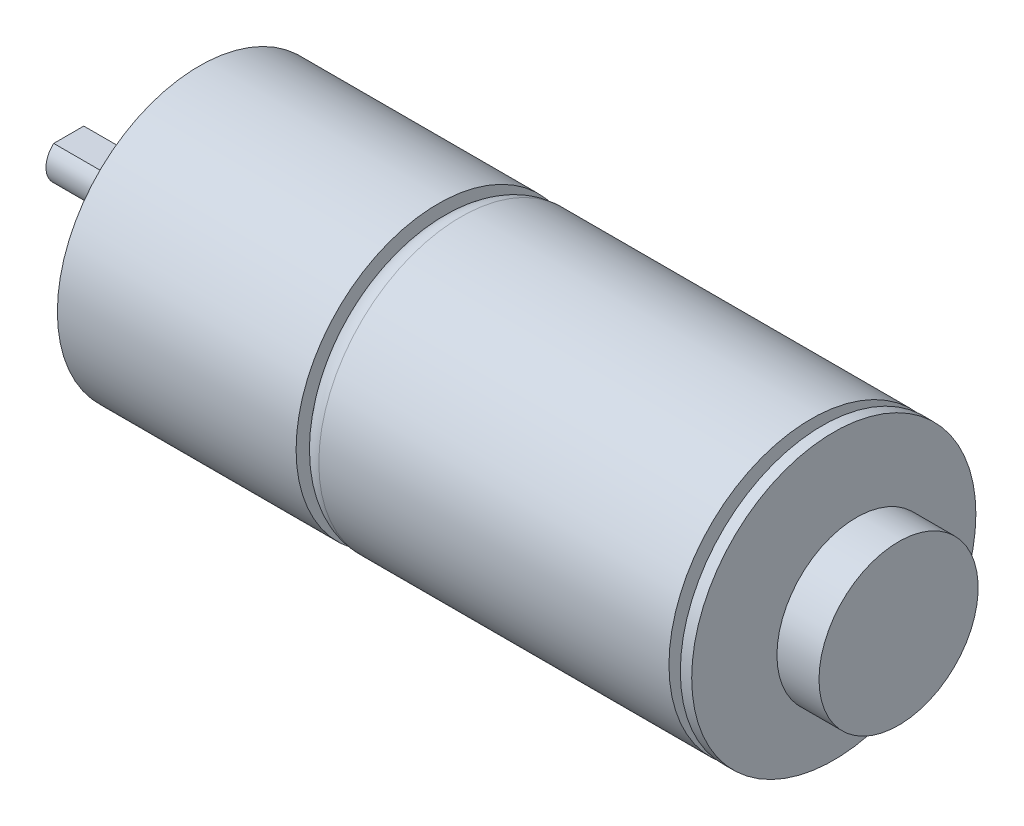
ISO-10303-21;
HEADER;
FILE_DESCRIPTION(('STEP AP214'),'2;1');
FILE_NAME('part.step','',(''),(''),'','','');
FILE_SCHEMA(('AUTOMOTIVE_DESIGN { 1 0 10303 214 1 1 1 1 }'));
ENDSEC;
DATA;
#1=APPLICATION_CONTEXT('core data for automotive mechanical design processes');
#2=APPLICATION_PROTOCOL_DEFINITION('international standard','automotive_design',2000,#1);
#3=PRODUCT_CONTEXT('',#1,'mechanical');
#4=PRODUCT('Part','Part','',(#3));
#5=PRODUCT_RELATED_PRODUCT_CATEGORY('part','',(#4));
#6=PRODUCT_DEFINITION_FORMATION('','',#4);
#7=PRODUCT_DEFINITION_CONTEXT('part definition',#1,'design');
#8=PRODUCT_DEFINITION('design','',#6,#7);
#9=PRODUCT_DEFINITION_SHAPE('','',#8);
#10=(LENGTH_UNIT() NAMED_UNIT(*) SI_UNIT(.MILLI.,.METRE.));
#11=(NAMED_UNIT(*) PLANE_ANGLE_UNIT() SI_UNIT($,.RADIAN.));
#12=(NAMED_UNIT(*) SI_UNIT($,.STERADIAN.) SOLID_ANGLE_UNIT());
#13=UNCERTAINTY_MEASURE_WITH_UNIT(LENGTH_MEASURE(1.E-05),#10,'distance_accuracy_value','');
#14=(GEOMETRIC_REPRESENTATION_CONTEXT(3) GLOBAL_UNCERTAINTY_ASSIGNED_CONTEXT((#13)) GLOBAL_UNIT_ASSIGNED_CONTEXT((#10,
#11,#12)) REPRESENTATION_CONTEXT('',''));
#15=CARTESIAN_POINT('',(0.,0.,0.));
#16=DIRECTION('',(0.,0.,1.));
#17=DIRECTION('',(1.,0.,0.));
#18=AXIS2_PLACEMENT_3D('',#15,#16,#17);
#19=CARTESIAN_POINT('',(0.,0.,0.));
#20=DIRECTION('',(1.,0.,0.));
#21=DIRECTION('',(0.,0.,-1.));
#22=AXIS2_PLACEMENT_3D('',#19,#20,#21);
#23=PLANE('',#22);
#24=CARTESIAN_POINT('',(0.,0.,0.));
#25=DIRECTION('',(-1.,0.,0.));
#26=DIRECTION('',(0.,0.,1.));
#27=AXIS2_PLACEMENT_3D('',#24,#25,#26);
#28=CIRCLE('',#27,2.);
#29=CARTESIAN_POINT('',(0.,1.5,-1.32287565553229));
#30=VERTEX_POINT('',#29);
#31=CARTESIAN_POINT('',(0.,1.5,1.32287565553229));
#32=VERTEX_POINT('',#31);
#33=EDGE_CURVE('E149',#30,#32,#28,.T.);
#34=ORIENTED_EDGE('',*,*,#33,.T.);
#35=DIRECTION('',(0.,0.,1.));
#36=VECTOR('',#35,1.);
#37=CARTESIAN_POINT('',(0.,1.5,-12.5));
#38=LINE('',#37,#36);
#39=EDGE_CURVE('E84',#30,#32,#38,.T.);
#40=ORIENTED_EDGE('',*,*,#39,.F.);
#41=EDGE_LOOP('',(#34,#40));
#42=FACE_BOUND('',#41,.T.);
#43=ADVANCED_FACE('F45',(#42),#23,.F.);
#44=CARTESIAN_POINT('',(0.,0.,0.));
#45=DIRECTION('',(-1.,0.,0.));
#46=DIRECTION('',(0.,0.,1.));
#47=AXIS2_PLACEMENT_3D('',#44,#45,#46);
#48=CYLINDRICAL_SURFACE('',#47,2.);
#49=CARTESIAN_POINT('',(8.,0.,0.));
#50=DIRECTION('',(1.,0.,0.));
#51=DIRECTION('',(0.,0.,-1.));
#52=AXIS2_PLACEMENT_3D('',#49,#50,#51);
#53=CIRCLE('',#52,2.);
#54=CARTESIAN_POINT('',(8.,1.5,-1.3228756555323));
#55=VERTEX_POINT('',#54);
#56=CARTESIAN_POINT('',(8.,1.5,1.32287565553229));
#57=VERTEX_POINT('',#56);
#58=EDGE_CURVE('E52',#55,#57,#53,.T.);
#59=ORIENTED_EDGE('',*,*,#58,.T.);
#60=DIRECTION('',(-1.,0.,0.));
#61=VECTOR('',#60,1.);
#62=CARTESIAN_POINT('',(0.,1.5,1.3228756555323));
#63=LINE('',#62,#61);
#64=EDGE_CURVE('E13',#57,#32,#63,.T.);
#65=ORIENTED_EDGE('',*,*,#64,.T.);
#66=ORIENTED_EDGE('',*,*,#33,.F.);
#67=DIRECTION('',(-1.,0.,0.));
#68=VECTOR('',#67,1.);
#69=CARTESIAN_POINT('',(0.,1.5,-1.3228756555323));
#70=LINE('',#69,#68);
#71=EDGE_CURVE('E80',#30,#55,#70,.F.);
#72=ORIENTED_EDGE('',*,*,#71,.T.);
#73=EDGE_LOOP('',(#59,#65,#66,#72));
#74=FACE_BOUND('',#73,.T.);
#75=CARTESIAN_POINT('',(9.,0.,0.));
#76=DIRECTION('',(-1.,0.,0.));
#77=DIRECTION('',(0.,0.,1.));
#78=AXIS2_PLACEMENT_3D('',#75,#76,#77);
#79=CIRCLE('',#78,2.);
#80=CARTESIAN_POINT('',(9.,0.,2.));
#81=VERTEX_POINT('',#80);
#82=EDGE_CURVE('E146',#81,#81,#79,.T.);
#83=ORIENTED_EDGE('',*,*,#82,.T.);
#84=EDGE_LOOP('',(#83));
#85=FACE_BOUND('',#84,.T.);
#86=ADVANCED_FACE('F76',(#74,#85),#48,.T.);
#87=CARTESIAN_POINT('',(10.5,0.,0.));
#88=DIRECTION('',(-1.,0.,0.));
#89=DIRECTION('',(0.,0.,1.));
#90=AXIS2_PLACEMENT_3D('',#87,#88,#89);
#91=TOROIDAL_SURFACE('',#90,2.,1.5);
#92=ORIENTED_EDGE('',*,*,#82,.F.);
#93=EDGE_LOOP('',(#92));
#94=FACE_BOUND('',#93,.T.);
#95=CARTESIAN_POINT('',(10.5,0.,0.));
#96=DIRECTION('',(-1.,0.,0.));
#97=DIRECTION('',(0.,0.,1.));
#98=AXIS2_PLACEMENT_3D('',#95,#96,#97);
#99=CIRCLE('',#98,3.5);
#100=CARTESIAN_POINT('',(10.5,0.,3.5));
#101=VERTEX_POINT('',#100);
#102=EDGE_CURVE('E143',#101,#101,#99,.T.);
#103=ORIENTED_EDGE('',*,*,#102,.T.);
#104=EDGE_LOOP('',(#103));
#105=FACE_BOUND('',#104,.T.);
#106=ADVANCED_FACE('F157',(#94,#105),#91,.T.);
#107=CARTESIAN_POINT('',(0.,0.,0.));
#108=DIRECTION('',(-1.,0.,0.));
#109=DIRECTION('',(0.,0.,1.));
#110=AXIS2_PLACEMENT_3D('',#107,#108,#109);
#111=CYLINDRICAL_SURFACE('',#110,3.5);
#112=ORIENTED_EDGE('',*,*,#102,.F.);
#113=EDGE_LOOP('',(#112));
#114=FACE_BOUND('',#113,.T.);
#115=CARTESIAN_POINT('',(11.5,0.,0.));
#116=DIRECTION('',(-1.,0.,0.));
#117=DIRECTION('',(0.,0.,1.));
#118=AXIS2_PLACEMENT_3D('',#115,#116,#117);
#119=CIRCLE('',#118,3.5);
#120=CARTESIAN_POINT('',(11.5,0.,3.5));
#121=VERTEX_POINT('',#120);
#122=EDGE_CURVE('E140',#121,#121,#119,.T.);
#123=ORIENTED_EDGE('',*,*,#122,.T.);
#124=EDGE_LOOP('',(#123));
#125=FACE_BOUND('',#124,.T.);
#126=ADVANCED_FACE('F162',(#114,#125),#111,.T.);
#127=CARTESIAN_POINT('',(11.5,3.5,0.));
#128=DIRECTION('',(1.,0.,0.));
#129=DIRECTION('',(0.,0.,-1.));
#130=AXIS2_PLACEMENT_3D('',#127,#128,#129);
#131=PLANE('',#130);
#132=CARTESIAN_POINT('',(11.5,0.,-8.5));
#133=DIRECTION('',(-1.,0.,0.));
#134=DIRECTION('',(0.,0.,1.));
#135=AXIS2_PLACEMENT_3D('',#132,#133,#134);
#136=CIRCLE('',#135,1.24999999999999);
#137=CARTESIAN_POINT('',(11.5,0.,-7.25000000000001));
#138=VERTEX_POINT('',#137);
#139=EDGE_CURVE('E86',#138,#138,#136,.T.);
#140=ORIENTED_EDGE('',*,*,#139,.F.);
#141=EDGE_LOOP('',(#140));
#142=FACE_BOUND('',#141,.T.);
#143=CARTESIAN_POINT('',(11.5,0.,8.5));
#144=DIRECTION('',(-1.,0.,0.));
#145=DIRECTION('',(0.,0.,1.));
#146=AXIS2_PLACEMENT_3D('',#143,#144,#145);
#147=CIRCLE('',#146,1.24999999999999);
#148=CARTESIAN_POINT('',(11.5,0.,9.74999999999999));
#149=VERTEX_POINT('',#148);
#150=EDGE_CURVE('E95',#149,#149,#147,.T.);
#151=ORIENTED_EDGE('',*,*,#150,.F.);
#152=EDGE_LOOP('',(#151));
#153=FACE_BOUND('',#152,.T.);
#154=ORIENTED_EDGE('',*,*,#122,.F.);
#155=EDGE_LOOP('',(#154));
#156=FACE_BOUND('',#155,.T.);
#157=CARTESIAN_POINT('',(11.5,0.,0.));
#158=DIRECTION('',(-1.,0.,0.));
#159=DIRECTION('',(0.,0.,1.));
#160=AXIS2_PLACEMENT_3D('',#157,#158,#159);
#161=CIRCLE('',#160,12.5);
#162=CARTESIAN_POINT('',(11.5,0.,12.5));
#163=VERTEX_POINT('',#162);
#164=EDGE_CURVE('E137',#163,#163,#161,.T.);
#165=ORIENTED_EDGE('',*,*,#164,.T.);
#166=EDGE_LOOP('',(#165));
#167=FACE_BOUND('',#166,.T.);
#168=ADVANCED_FACE('F168',(#142,#153,#156,#167),#131,.F.);
#169=CARTESIAN_POINT('',(0.,0.,0.));
#170=DIRECTION('',(-1.,0.,0.));
#171=DIRECTION('',(0.,0.,1.));
#172=AXIS2_PLACEMENT_3D('',#169,#170,#171);
#173=CYLINDRICAL_SURFACE('',#172,12.5);
#174=ORIENTED_EDGE('',*,*,#164,.F.);
#175=EDGE_LOOP('',(#174));
#176=FACE_BOUND('',#175,.T.);
#177=CARTESIAN_POINT('',(32.5,0.,0.));
#178=DIRECTION('',(-1.,0.,0.));
#179=DIRECTION('',(0.,0.,1.));
#180=AXIS2_PLACEMENT_3D('',#177,#178,#179);
#181=CIRCLE('',#180,12.5);
#182=CARTESIAN_POINT('',(32.5,0.,12.5));
#183=VERTEX_POINT('',#182);
#184=EDGE_CURVE('E134',#183,#183,#181,.T.);
#185=ORIENTED_EDGE('',*,*,#184,.T.);
#186=EDGE_LOOP('',(#185));
#187=FACE_BOUND('',#186,.T.);
#188=ADVANCED_FACE('F172',(#176,#187),#173,.T.);
#189=CARTESIAN_POINT('',(32.5,12.5,0.));
#190=DIRECTION('',(-1.,0.,0.));
#191=DIRECTION('',(0.,0.,1.));
#192=AXIS2_PLACEMENT_3D('',#189,#190,#191);
#193=PLANE('',#192);
#194=ORIENTED_EDGE('',*,*,#184,.F.);
#195=EDGE_LOOP('',(#194));
#196=FACE_BOUND('',#195,.T.);
#197=CARTESIAN_POINT('',(32.5,0.,0.));
#198=DIRECTION('',(-1.,0.,0.));
#199=DIRECTION('',(0.,0.,1.));
#200=AXIS2_PLACEMENT_3D('',#197,#198,#199);
#201=CIRCLE('',#200,10.5);
#202=CARTESIAN_POINT('',(32.5,0.,10.5));
#203=VERTEX_POINT('',#202);
#204=EDGE_CURVE('E131',#203,#203,#201,.T.);
#205=ORIENTED_EDGE('',*,*,#204,.T.);
#206=EDGE_LOOP('',(#205));
#207=FACE_BOUND('',#206,.T.);
#208=ADVANCED_FACE('F176',(#196,#207),#193,.F.);
#209=CARTESIAN_POINT('',(34.5,0.,0.));
#210=DIRECTION('',(-1.,0.,0.));
#211=DIRECTION('',(0.,0.,1.));
#212=AXIS2_PLACEMENT_3D('',#209,#210,#211);
#213=TOROIDAL_SURFACE('',#212,10.5,2.);
#214=ORIENTED_EDGE('',*,*,#204,.F.);
#215=EDGE_LOOP('',(#214));
#216=FACE_BOUND('',#215,.T.);
#217=CARTESIAN_POINT('',(34.5,0.,0.));
#218=DIRECTION('',(-1.,0.,0.));
#219=DIRECTION('',(0.,0.,1.));
#220=AXIS2_PLACEMENT_3D('',#217,#218,#219);
#221=CIRCLE('',#220,12.5);
#222=CARTESIAN_POINT('',(34.5,0.,12.5));
#223=VERTEX_POINT('',#222);
#224=EDGE_CURVE('E128',#223,#223,#221,.T.);
#225=ORIENTED_EDGE('',*,*,#224,.T.);
#226=EDGE_LOOP('',(#225));
#227=FACE_BOUND('',#226,.T.);
#228=ADVANCED_FACE('F180',(#216,#227),#213,.T.);
#229=CARTESIAN_POINT('',(0.,0.,0.));
#230=DIRECTION('',(-1.,0.,0.));
#231=DIRECTION('',(0.,0.,1.));
#232=AXIS2_PLACEMENT_3D('',#229,#230,#231);
#233=CYLINDRICAL_SURFACE('',#232,12.5);
#234=ORIENTED_EDGE('',*,*,#224,.F.);
#235=EDGE_LOOP('',(#234));
#236=FACE_BOUND('',#235,.T.);
#237=CARTESIAN_POINT('',(65.3,0.,0.));
#238=DIRECTION('',(-1.,0.,0.));
#239=DIRECTION('',(0.,0.,1.));
#240=AXIS2_PLACEMENT_3D('',#237,#238,#239);
#241=CIRCLE('',#240,12.5);
#242=CARTESIAN_POINT('',(65.3,0.,12.5));
#243=VERTEX_POINT('',#242);
#244=EDGE_CURVE('E125',#243,#243,#241,.T.);
#245=ORIENTED_EDGE('',*,*,#244,.T.);
#246=EDGE_LOOP('',(#245));
#247=FACE_BOUND('',#246,.T.);
#248=ADVANCED_FACE('F184',(#236,#247),#233,.T.);
#249=CARTESIAN_POINT('',(65.3,12.5,0.));
#250=DIRECTION('',(-1.,0.,0.));
#251=DIRECTION('',(0.,0.,1.));
#252=AXIS2_PLACEMENT_3D('',#249,#250,#251);
#253=PLANE('',#252);
#254=ORIENTED_EDGE('',*,*,#244,.F.);
#255=EDGE_LOOP('',(#254));
#256=FACE_BOUND('',#255,.T.);
#257=CARTESIAN_POINT('',(65.3,0.,0.));
#258=DIRECTION('',(-1.,0.,0.));
#259=DIRECTION('',(0.,0.,1.));
#260=AXIS2_PLACEMENT_3D('',#257,#258,#259);
#261=CIRCLE('',#260,3.5);
#262=CARTESIAN_POINT('',(65.3,0.,3.5));
#263=VERTEX_POINT('',#262);
#264=EDGE_CURVE('E122',#263,#263,#261,.T.);
#265=ORIENTED_EDGE('',*,*,#264,.T.);
#266=EDGE_LOOP('',(#265));
#267=FACE_BOUND('',#266,.T.);
#268=ADVANCED_FACE('F188',(#256,#267),#253,.F.);
#269=CARTESIAN_POINT('',(0.,0.,0.));
#270=DIRECTION('',(-1.,0.,0.));
#271=DIRECTION('',(0.,0.,1.));
#272=AXIS2_PLACEMENT_3D('',#269,#270,#271);
#273=CYLINDRICAL_SURFACE('',#272,3.5);
#274=ORIENTED_EDGE('',*,*,#264,.F.);
#275=EDGE_LOOP('',(#274));
#276=FACE_BOUND('',#275,.T.);
#277=CARTESIAN_POINT('',(66.3,0.,0.));
#278=DIRECTION('',(-1.,0.,0.));
#279=DIRECTION('',(0.,0.,1.));
#280=AXIS2_PLACEMENT_3D('',#277,#278,#279);
#281=CIRCLE('',#280,3.5);
#282=CARTESIAN_POINT('',(66.3,0.,3.5));
#283=VERTEX_POINT('',#282);
#284=EDGE_CURVE('E119',#283,#283,#281,.T.);
#285=ORIENTED_EDGE('',*,*,#284,.T.);
#286=EDGE_LOOP('',(#285));
#287=FACE_BOUND('',#286,.T.);
#288=ADVANCED_FACE('F192',(#276,#287),#273,.T.);
#289=CARTESIAN_POINT('',(66.3,3.5,0.));
#290=DIRECTION('',(1.,0.,0.));
#291=DIRECTION('',(0.,0.,-1.));
#292=AXIS2_PLACEMENT_3D('',#289,#290,#291);
#293=PLANE('',#292);
#294=ORIENTED_EDGE('',*,*,#284,.F.);
#295=EDGE_LOOP('',(#294));
#296=FACE_BOUND('',#295,.T.);
#297=CARTESIAN_POINT('',(66.3,0.,0.));
#298=DIRECTION('',(-1.,0.,0.));
#299=DIRECTION('',(0.,0.,1.));
#300=AXIS2_PLACEMENT_3D('',#297,#298,#299);
#301=CIRCLE('',#300,12.5);
#302=CARTESIAN_POINT('',(66.3,0.,12.5));
#303=VERTEX_POINT('',#302);
#304=EDGE_CURVE('E116',#303,#303,#301,.T.);
#305=ORIENTED_EDGE('',*,*,#304,.T.);
#306=EDGE_LOOP('',(#305));
#307=FACE_BOUND('',#306,.T.);
#308=ADVANCED_FACE('F196',(#296,#307),#293,.F.);
#309=CARTESIAN_POINT('',(0.,0.,0.));
#310=DIRECTION('',(-1.,0.,0.));
#311=DIRECTION('',(0.,0.,1.));
#312=AXIS2_PLACEMENT_3D('',#309,#310,#311);
#313=CYLINDRICAL_SURFACE('',#312,12.5);
#314=ORIENTED_EDGE('',*,*,#304,.F.);
#315=EDGE_LOOP('',(#314));
#316=FACE_BOUND('',#315,.T.);
#317=CARTESIAN_POINT('',(67.3,0.,0.));
#318=DIRECTION('',(-1.,0.,0.));
#319=DIRECTION('',(0.,0.,1.));
#320=AXIS2_PLACEMENT_3D('',#317,#318,#319);
#321=CIRCLE('',#320,12.5);
#322=CARTESIAN_POINT('',(67.3,0.,12.5));
#323=VERTEX_POINT('',#322);
#324=EDGE_CURVE('E113',#323,#323,#321,.T.);
#325=ORIENTED_EDGE('',*,*,#324,.T.);
#326=EDGE_LOOP('',(#325));
#327=FACE_BOUND('',#326,.T.);
#328=ADVANCED_FACE('F200',(#316,#327),#313,.T.);
#329=CARTESIAN_POINT('',(67.3,12.5,0.));
#330=DIRECTION('',(-1.,0.,0.));
#331=DIRECTION('',(0.,0.,1.));
#332=AXIS2_PLACEMENT_3D('',#329,#330,#331);
#333=PLANE('',#332);
#334=ORIENTED_EDGE('',*,*,#324,.F.);
#335=EDGE_LOOP('',(#334));
#336=FACE_BOUND('',#335,.T.);
#337=CARTESIAN_POINT('',(67.3,0.,0.));
#338=DIRECTION('',(-1.,0.,0.));
#339=DIRECTION('',(0.,0.,1.));
#340=AXIS2_PLACEMENT_3D('',#337,#338,#339);
#341=CIRCLE('',#340,2.5);
#342=CARTESIAN_POINT('',(67.3,0.,2.5));
#343=VERTEX_POINT('',#342);
#344=EDGE_CURVE('E110',#343,#343,#341,.T.);
#345=ORIENTED_EDGE('',*,*,#344,.T.);
#346=EDGE_LOOP('',(#345));
#347=FACE_BOUND('',#346,.T.);
#348=ADVANCED_FACE('F204',(#336,#347),#333,.F.);
#349=CARTESIAN_POINT('',(0.,0.,0.));
#350=DIRECTION('',(-1.,0.,0.));
#351=DIRECTION('',(0.,0.,1.));
#352=AXIS2_PLACEMENT_3D('',#349,#350,#351);
#353=CYLINDRICAL_SURFACE('',#352,2.5);
#354=ORIENTED_EDGE('',*,*,#344,.F.);
#355=EDGE_LOOP('',(#354));
#356=FACE_BOUND('',#355,.T.);
#357=CARTESIAN_POINT('',(69.3,0.,0.));
#358=DIRECTION('',(-1.,0.,0.));
#359=DIRECTION('',(0.,0.,1.));
#360=AXIS2_PLACEMENT_3D('',#357,#358,#359);
#361=CIRCLE('',#360,2.5);
#362=CARTESIAN_POINT('',(69.3,0.,2.5));
#363=VERTEX_POINT('',#362);
#364=EDGE_CURVE('E107',#363,#363,#361,.T.);
#365=ORIENTED_EDGE('',*,*,#364,.T.);
#366=EDGE_LOOP('',(#365));
#367=FACE_BOUND('',#366,.T.);
#368=ADVANCED_FACE('F208',(#356,#367),#353,.T.);
#369=CARTESIAN_POINT('',(69.3,2.5,0.));
#370=DIRECTION('',(1.,0.,0.));
#371=DIRECTION('',(0.,0.,-1.));
#372=AXIS2_PLACEMENT_3D('',#369,#370,#371);
#373=PLANE('',#372);
#374=ORIENTED_EDGE('',*,*,#364,.F.);
#375=EDGE_LOOP('',(#374));
#376=FACE_BOUND('',#375,.T.);
#377=CARTESIAN_POINT('',(69.3,0.,0.));
#378=DIRECTION('',(-1.,0.,0.));
#379=DIRECTION('',(0.,0.,1.));
#380=AXIS2_PLACEMENT_3D('',#377,#378,#379);
#381=CIRCLE('',#380,7.);
#382=CARTESIAN_POINT('',(69.3,0.,7.));
#383=VERTEX_POINT('',#382);
#384=EDGE_CURVE('E104',#383,#383,#381,.T.);
#385=ORIENTED_EDGE('',*,*,#384,.T.);
#386=EDGE_LOOP('',(#385));
#387=FACE_BOUND('',#386,.T.);
#388=ADVANCED_FACE('F212',(#376,#387),#373,.F.);
#389=CARTESIAN_POINT('',(0.,0.,0.));
#390=DIRECTION('',(-1.,0.,0.));
#391=DIRECTION('',(0.,0.,1.));
#392=AXIS2_PLACEMENT_3D('',#389,#390,#391);
#393=CYLINDRICAL_SURFACE('',#392,7.);
#394=ORIENTED_EDGE('',*,*,#384,.F.);
#395=EDGE_LOOP('',(#394));
#396=FACE_BOUND('',#395,.T.);
#397=CARTESIAN_POINT('',(73.,0.,0.));
#398=DIRECTION('',(-1.,0.,0.));
#399=DIRECTION('',(0.,0.,1.));
#400=AXIS2_PLACEMENT_3D('',#397,#398,#399);
#401=CIRCLE('',#400,7.);
#402=CARTESIAN_POINT('',(73.,0.,7.));
#403=VERTEX_POINT('',#402);
#404=EDGE_CURVE('E101',#403,#403,#401,.T.);
#405=ORIENTED_EDGE('',*,*,#404,.T.);
#406=EDGE_LOOP('',(#405));
#407=FACE_BOUND('',#406,.T.);
#408=ADVANCED_FACE('F216',(#396,#407),#393,.T.);
#409=CARTESIAN_POINT('',(73.,7.,0.));
#410=DIRECTION('',(-1.,0.,0.));
#411=DIRECTION('',(0.,0.,1.));
#412=AXIS2_PLACEMENT_3D('',#409,#410,#411);
#413=PLANE('',#412);
#414=ORIENTED_EDGE('',*,*,#404,.F.);
#415=EDGE_LOOP('',(#414));
#416=FACE_BOUND('',#415,.T.);
#417=ADVANCED_FACE('F220',(#416),#413,.F.);
#418=CARTESIAN_POINT('',(14.5,0.,8.5));
#419=DIRECTION('',(-1.,0.,0.));
#420=DIRECTION('',(0.,0.,1.));
#421=AXIS2_PLACEMENT_3D('',#418,#419,#420);
#422=CONICAL_SURFACE('',#421,1.25,1.02974425867665);
#423=CARTESIAN_POINT('',(15.2510757737845,0.,8.5));
#424=VERTEX_POINT('',#423);
#425=VERTEX_LOOP('',#424);
#426=FACE_BOUND('',#425,.T.);
#427=CARTESIAN_POINT('',(14.5,0.,8.5));
#428=DIRECTION('',(-1.,0.,0.));
#429=DIRECTION('',(0.,0.,1.));
#430=AXIS2_PLACEMENT_3D('',#427,#428,#429);
#431=CIRCLE('',#430,1.25);
#432=CARTESIAN_POINT('',(14.5,0.,9.75));
#433=VERTEX_POINT('',#432);
#434=EDGE_CURVE('E98',#433,#433,#431,.T.);
#435=ORIENTED_EDGE('',*,*,#434,.T.);
#436=EDGE_LOOP('',(#435));
#437=FACE_BOUND('',#436,.T.);
#438=ADVANCED_FACE('F224',(#426,#437),#422,.F.);
#439=CARTESIAN_POINT('',(11.5,0.,8.5));
#440=DIRECTION('',(-1.,0.,0.));
#441=DIRECTION('',(0.,0.,1.));
#442=AXIS2_PLACEMENT_3D('',#439,#440,#441);
#443=CYLINDRICAL_SURFACE('',#442,1.24999999999999);
#444=ORIENTED_EDGE('',*,*,#434,.F.);
#445=EDGE_LOOP('',(#444));
#446=FACE_BOUND('',#445,.T.);
#447=ORIENTED_EDGE('',*,*,#150,.T.);
#448=EDGE_LOOP('',(#447));
#449=FACE_BOUND('',#448,.T.);
#450=ADVANCED_FACE('F228',(#446,#449),#443,.F.);
#451=CARTESIAN_POINT('',(14.5,0.,-8.5));
#452=DIRECTION('',(-1.,0.,0.));
#453=DIRECTION('',(0.,0.,1.));
#454=AXIS2_PLACEMENT_3D('',#451,#452,#453);
#455=CONICAL_SURFACE('',#454,1.25,1.02974425867665);
#456=CARTESIAN_POINT('',(15.2510757737845,0.,-8.5));
#457=VERTEX_POINT('',#456);
#458=VERTEX_LOOP('',#457);
#459=FACE_BOUND('',#458,.T.);
#460=CARTESIAN_POINT('',(14.5,0.,-8.5));
#461=DIRECTION('',(-1.,0.,0.));
#462=DIRECTION('',(0.,0.,1.));
#463=AXIS2_PLACEMENT_3D('',#460,#461,#462);
#464=CIRCLE('',#463,1.25);
#465=CARTESIAN_POINT('',(14.5,0.,-7.25));
#466=VERTEX_POINT('',#465);
#467=EDGE_CURVE('E89',#466,#466,#464,.T.);
#468=ORIENTED_EDGE('',*,*,#467,.T.);
#469=EDGE_LOOP('',(#468));
#470=FACE_BOUND('',#469,.T.);
#471=ADVANCED_FACE('F231',(#459,#470),#455,.F.);
#472=CARTESIAN_POINT('',(11.5,0.,-8.5));
#473=DIRECTION('',(-1.,0.,0.));
#474=DIRECTION('',(0.,0.,1.));
#475=AXIS2_PLACEMENT_3D('',#472,#473,#474);
#476=CYLINDRICAL_SURFACE('',#475,1.24999999999999);
#477=ORIENTED_EDGE('',*,*,#467,.F.);
#478=EDGE_LOOP('',(#477));
#479=FACE_BOUND('',#478,.T.);
#480=ORIENTED_EDGE('',*,*,#139,.T.);
#481=EDGE_LOOP('',(#480));
#482=FACE_BOUND('',#481,.T.);
#483=ADVANCED_FACE('F235',(#479,#482),#476,.F.);
#484=CARTESIAN_POINT('',(8.,1.5,-12.5));
#485=DIRECTION('',(1.,0.,0.));
#486=DIRECTION('',(0.,0.,-1.));
#487=AXIS2_PLACEMENT_3D('',#484,#485,#486);
#488=PLANE('',#487);
#489=DIRECTION('',(0.,0.,1.));
#490=VECTOR('',#489,1.);
#491=CARTESIAN_POINT('',(8.,1.5,-12.5));
#492=LINE('',#491,#490);
#493=EDGE_CURVE('E59',#55,#57,#492,.T.);
#494=ORIENTED_EDGE('',*,*,#493,.T.);
#495=ORIENTED_EDGE('',*,*,#58,.F.);
#496=EDGE_LOOP('',(#494,#495));
#497=FACE_BOUND('',#496,.T.);
#498=ADVANCED_FACE('F85',(#497),#488,.F.);
#499=CARTESIAN_POINT('',(0.,1.5,-12.5));
#500=DIRECTION('',(0.,-1.,0.));
#501=DIRECTION('',(0.,0.,-1.));
#502=AXIS2_PLACEMENT_3D('',#499,#500,#501);
#503=PLANE('',#502);
#504=ORIENTED_EDGE('',*,*,#493,.F.);
#505=ORIENTED_EDGE('',*,*,#71,.F.);
#506=ORIENTED_EDGE('',*,*,#39,.T.);
#507=ORIENTED_EDGE('',*,*,#64,.F.);
#508=EDGE_LOOP('',(#504,#505,#506,#507));
#509=FACE_BOUND('',#508,.T.);
#510=ADVANCED_FACE('F82',(#509),#503,.F.);
#511=CLOSED_SHELL('',(#43,#86,#106,#126,#168,#188,#208,#228,#248,#268,#288,#308,#328,#348,#368,
#388,#408,#417,#438,#450,#471,#483,#498,#510));
#512=MANIFOLD_SOLID_BREP('B2',#511);
#513=ADVANCED_BREP_SHAPE_REPRESENTATION('',(#18,#512),#14);
#514=SHAPE_DEFINITION_REPRESENTATION(#9,#513);
ENDSEC;
END-ISO-10303-21;
